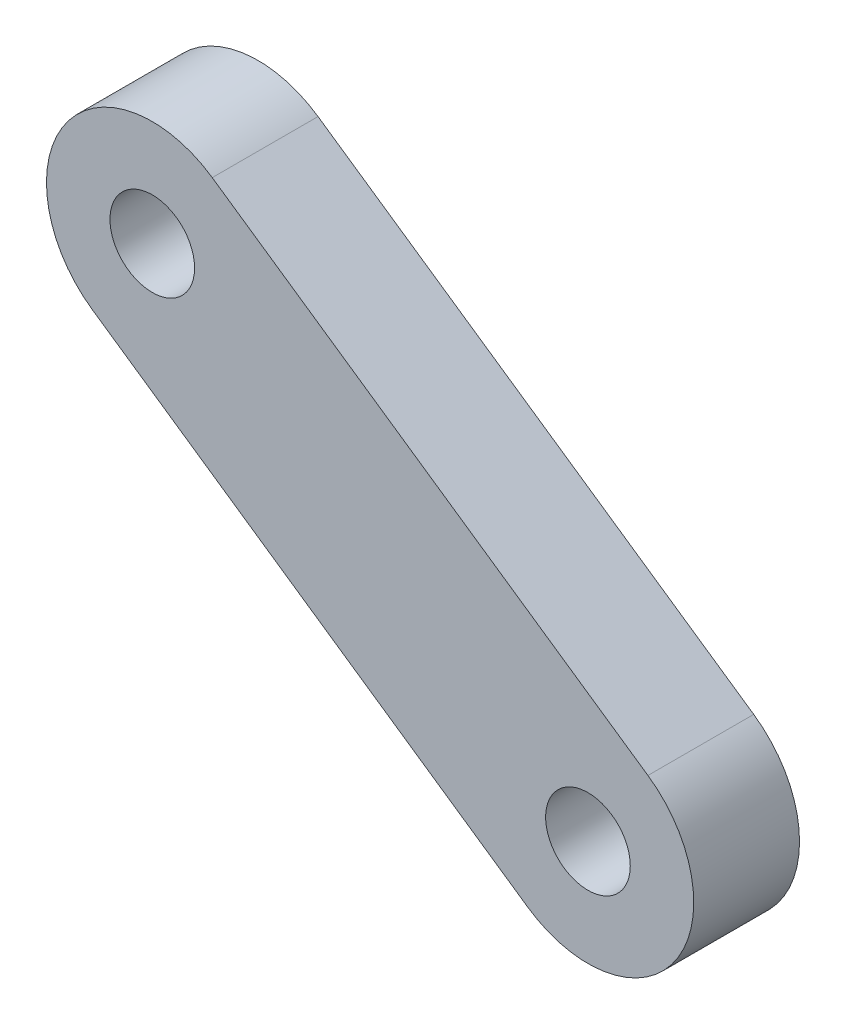
ISO-10303-21;
HEADER;
FILE_DESCRIPTION(('STEP AP214'),'2;1');
FILE_NAME('part.step','',(''),(''),'','','');
FILE_SCHEMA(('AUTOMOTIVE_DESIGN { 1 0 10303 214 1 1 1 1 }'));
ENDSEC;
DATA;
#1=APPLICATION_CONTEXT('core data for automotive mechanical design processes');
#2=APPLICATION_PROTOCOL_DEFINITION('international standard','automotive_design',2000,#1);
#3=PRODUCT_CONTEXT('',#1,'mechanical');
#4=PRODUCT('Part','Part','',(#3));
#5=PRODUCT_RELATED_PRODUCT_CATEGORY('part','',(#4));
#6=PRODUCT_DEFINITION_FORMATION('','',#4);
#7=PRODUCT_DEFINITION_CONTEXT('part definition',#1,'design');
#8=PRODUCT_DEFINITION('design','',#6,#7);
#9=PRODUCT_DEFINITION_SHAPE('','',#8);
#10=(LENGTH_UNIT() NAMED_UNIT(*) SI_UNIT(.MILLI.,.METRE.));
#11=(NAMED_UNIT(*) PLANE_ANGLE_UNIT() SI_UNIT($,.RADIAN.));
#12=(NAMED_UNIT(*) SI_UNIT($,.STERADIAN.) SOLID_ANGLE_UNIT());
#13=UNCERTAINTY_MEASURE_WITH_UNIT(LENGTH_MEASURE(1.E-05),#10,'distance_accuracy_value','');
#14=(GEOMETRIC_REPRESENTATION_CONTEXT(3) GLOBAL_UNCERTAINTY_ASSIGNED_CONTEXT((#13)) GLOBAL_UNIT_ASSIGNED_CONTEXT((#10,
#11,#12)) REPRESENTATION_CONTEXT('',''));
#15=CARTESIAN_POINT('',(0.,0.,0.));
#16=DIRECTION('',(0.,0.,1.));
#17=DIRECTION('',(1.,0.,0.));
#18=AXIS2_PLACEMENT_3D('',#15,#16,#17);
#19=CARTESIAN_POINT('',(22.4546862512256,32.6242146663216,5.));
#20=DIRECTION('',(0.566966615087807,0.823740770737903,0.));
#21=DIRECTION('',(-0.823740770737903,0.566966615087807,0.));
#22=AXIS2_PLACEMENT_3D('',#19,#20,#21);
#23=PLANE('',#22);
#24=DIRECTION('',(0.823740770737903,-0.566966615087807,0.));
#25=VECTOR('',#24,1.);
#26=CARTESIAN_POINT('',(22.4546862512256,32.6242146663216,0.));
#27=LINE('',#26,#25);
#28=CARTESIAN_POINT('',(-47.2149749394553,80.5766450701372,0.));
#29=VERTEX_POINT('',#28);
#30=CARTESIAN_POINT('',(-26.6214556710077,66.402479692942,0.));
#31=VERTEX_POINT('',#30);
#32=EDGE_CURVE('E106',#29,#31,#27,.T.);
#33=ORIENTED_EDGE('',*,*,#32,.T.);
#34=DIRECTION('',(0.,0.,-1.));
#35=VECTOR('',#34,1.);
#36=CARTESIAN_POINT('',(-26.6214556710077,66.402479692942,5.));
#37=LINE('',#36,#35);
#38=CARTESIAN_POINT('',(-26.6214556710077,66.402479692942,5.));
#39=VERTEX_POINT('',#38);
#40=EDGE_CURVE('E11',#39,#31,#37,.T.);
#41=ORIENTED_EDGE('',*,*,#40,.F.);
#42=DIRECTION('',(0.823740770737903,-0.566966615087807,0.));
#43=VECTOR('',#42,1.);
#44=CARTESIAN_POINT('',(22.4546862512256,32.6242146663216,5.));
#45=LINE('',#44,#43);
#46=CARTESIAN_POINT('',(-47.2149749394553,80.5766450701372,5.));
#47=VERTEX_POINT('',#46);
#48=EDGE_CURVE('E85',#47,#39,#45,.T.);
#49=ORIENTED_EDGE('',*,*,#48,.F.);
#50=DIRECTION('',(0.,0.,-1.));
#51=VECTOR('',#50,1.);
#52=CARTESIAN_POINT('',(-47.2149749394553,80.5766450701372,5.));
#53=LINE('',#52,#51);
#54=EDGE_CURVE('E96',#47,#29,#53,.T.);
#55=ORIENTED_EDGE('',*,*,#54,.T.);
#56=EDGE_LOOP('',(#33,#41,#49,#55));
#57=FACE_BOUND('',#56,.T.);
#58=ADVANCED_FACE('F37',(#57),#23,.F.);
#59=CARTESIAN_POINT('',(-23.7866225955687,70.5211835466315,5.));
#60=DIRECTION('',(0.,0.,-1.));
#61=DIRECTION('',(-1.,0.,0.));
#62=AXIS2_PLACEMENT_3D('',#59,#60,#61);
#63=CYLINDRICAL_SURFACE('',#62,4.99999999999997);
#64=CARTESIAN_POINT('',(-23.7866225955687,70.5211835466315,0.));
#65=DIRECTION('',(0.,0.,1.));
#66=DIRECTION('',(1.,0.,0.));
#67=AXIS2_PLACEMENT_3D('',#64,#65,#66);
#68=CIRCLE('',#67,4.99999999999997);
#69=CARTESIAN_POINT('',(-20.9517895201297,74.639887400321,0.));
#70=VERTEX_POINT('',#69);
#71=EDGE_CURVE('E90',#31,#70,#68,.T.);
#72=ORIENTED_EDGE('',*,*,#71,.T.);
#73=DIRECTION('',(0.,0.,-1.));
#74=VECTOR('',#73,1.);
#75=CARTESIAN_POINT('',(-20.9517895201297,74.639887400321,5.));
#76=LINE('',#75,#74);
#77=CARTESIAN_POINT('',(-20.9517895201297,74.639887400321,5.));
#78=VERTEX_POINT('',#77);
#79=EDGE_CURVE('E46',#78,#70,#76,.T.);
#80=ORIENTED_EDGE('',*,*,#79,.F.);
#81=CARTESIAN_POINT('',(-23.7866225955687,70.5211835466315,5.));
#82=DIRECTION('',(0.,0.,1.));
#83=DIRECTION('',(1.,0.,0.));
#84=AXIS2_PLACEMENT_3D('',#81,#82,#83);
#85=CIRCLE('',#84,4.99999999999997);
#86=EDGE_CURVE('E80',#39,#78,#85,.T.);
#87=ORIENTED_EDGE('',*,*,#86,.F.);
#88=ORIENTED_EDGE('',*,*,#40,.T.);
#89=EDGE_LOOP('',(#72,#80,#87,#88));
#90=FACE_BOUND('',#89,.T.);
#91=ADVANCED_FACE('F89',(#90),#63,.T.);
#92=CARTESIAN_POINT('',(28.1243524021036,40.8616223737004,5.));
#93=DIRECTION('',(0.56696661508781,0.823740770737901,0.));
#94=DIRECTION('',(-0.823740770737901,0.56696661508781,0.));
#95=AXIS2_PLACEMENT_3D('',#92,#93,#94);
#96=PLANE('',#95);
#97=DIRECTION('',(0.823740770737901,-0.56696661508781,0.));
#98=VECTOR('',#97,1.);
#99=CARTESIAN_POINT('',(28.1243524021036,40.8616223737004,0.));
#100=LINE('',#99,#98);
#101=CARTESIAN_POINT('',(-41.5453087885772,88.8140527775162,0.));
#102=VERTEX_POINT('',#101);
#103=EDGE_CURVE('E110',#102,#70,#100,.T.);
#104=ORIENTED_EDGE('',*,*,#103,.F.);
#105=DIRECTION('',(0.,0.,-1.));
#106=VECTOR('',#105,1.);
#107=CARTESIAN_POINT('',(-41.5453087885772,88.8140527775162,5.));
#108=LINE('',#107,#106);
#109=CARTESIAN_POINT('',(-41.5453087885772,88.8140527775162,5.));
#110=VERTEX_POINT('',#109);
#111=EDGE_CURVE('E70',#110,#102,#108,.T.);
#112=ORIENTED_EDGE('',*,*,#111,.F.);
#113=DIRECTION('',(0.823740770737901,-0.56696661508781,0.));
#114=VECTOR('',#113,1.);
#115=CARTESIAN_POINT('',(28.1243524021036,40.8616223737004,5.));
#116=LINE('',#115,#114);
#117=EDGE_CURVE('E83',#110,#78,#116,.T.);
#118=ORIENTED_EDGE('',*,*,#117,.T.);
#119=ORIENTED_EDGE('',*,*,#79,.T.);
#120=EDGE_LOOP('',(#104,#112,#118,#119));
#121=FACE_BOUND('',#120,.T.);
#122=ADVANCED_FACE('F94',(#121),#96,.T.);
#123=CARTESIAN_POINT('',(-44.3801418640162,84.6953489238267,5.));
#124=DIRECTION('',(0.,0.,-1.));
#125=DIRECTION('',(-1.,0.,0.));
#126=AXIS2_PLACEMENT_3D('',#123,#124,#125);
#127=CYLINDRICAL_SURFACE('',#126,2.);
#128=CARTESIAN_POINT('',(-44.3801418640162,84.6953489238267,5.));
#129=DIRECTION('',(0.,0.,1.));
#130=DIRECTION('',(1.,0.,0.));
#131=AXIS2_PLACEMENT_3D('',#128,#129,#130);
#132=CIRCLE('',#131,2.);
#133=CARTESIAN_POINT('',(-42.3801418640162,84.6953489238267,5.));
#134=VERTEX_POINT('',#133);
#135=EDGE_CURVE('E148',#134,#134,#132,.T.);
#136=ORIENTED_EDGE('',*,*,#135,.T.);
#137=EDGE_LOOP('',(#136));
#138=FACE_BOUND('',#137,.T.);
#139=CARTESIAN_POINT('',(-44.3801418640162,84.6953489238267,0.));
#140=DIRECTION('',(0.,0.,1.));
#141=DIRECTION('',(1.,0.,0.));
#142=AXIS2_PLACEMENT_3D('',#139,#140,#141);
#143=CIRCLE('',#142,2.);
#144=CARTESIAN_POINT('',(-42.3801418640162,84.6953489238267,0.));
#145=VERTEX_POINT('',#144);
#146=EDGE_CURVE('E103',#145,#145,#143,.T.);
#147=ORIENTED_EDGE('',*,*,#146,.F.);
#148=EDGE_LOOP('',(#147));
#149=FACE_BOUND('',#148,.T.);
#150=ADVANCED_FACE('F137',(#138,#149),#127,.F.);
#151=CARTESIAN_POINT('',(-23.7866225955687,70.5211835466315,5.));
#152=DIRECTION('',(0.,0.,-1.));
#153=DIRECTION('',(-1.,0.,0.));
#154=AXIS2_PLACEMENT_3D('',#151,#152,#153);
#155=CYLINDRICAL_SURFACE('',#154,2.00000000000001);
#156=CARTESIAN_POINT('',(-23.7866225955687,70.5211835466315,5.));
#157=DIRECTION('',(0.,0.,1.));
#158=DIRECTION('',(1.,0.,0.));
#159=AXIS2_PLACEMENT_3D('',#156,#157,#158);
#160=CIRCLE('',#159,2.00000000000001);
#161=CARTESIAN_POINT('',(-21.7866225955687,70.5211835466315,5.));
#162=VERTEX_POINT('',#161);
#163=EDGE_CURVE('E113',#162,#162,#160,.T.);
#164=ORIENTED_EDGE('',*,*,#163,.T.);
#165=EDGE_LOOP('',(#164));
#166=FACE_BOUND('',#165,.T.);
#167=CARTESIAN_POINT('',(-23.7866225955687,70.5211835466315,0.));
#168=DIRECTION('',(0.,0.,1.));
#169=DIRECTION('',(1.,0.,0.));
#170=AXIS2_PLACEMENT_3D('',#167,#168,#169);
#171=CIRCLE('',#170,2.00000000000001);
#172=CARTESIAN_POINT('',(-21.7866225955687,70.5211835466315,0.));
#173=VERTEX_POINT('',#172);
#174=EDGE_CURVE('E100',#173,#173,#171,.T.);
#175=ORIENTED_EDGE('',*,*,#174,.F.);
#176=EDGE_LOOP('',(#175));
#177=FACE_BOUND('',#176,.T.);
#178=ADVANCED_FACE('F39',(#166,#177),#155,.F.);
#179=CARTESIAN_POINT('',(-44.3801418640162,84.6953489238267,5.));
#180=DIRECTION('',(0.,0.,-1.));
#181=DIRECTION('',(-1.,0.,0.));
#182=AXIS2_PLACEMENT_3D('',#179,#180,#181);
#183=CYLINDRICAL_SURFACE('',#182,5.);
#184=CARTESIAN_POINT('',(-44.3801418640162,84.6953489238267,0.));
#185=DIRECTION('',(0.,0.,1.));
#186=DIRECTION('',(1.,0.,0.));
#187=AXIS2_PLACEMENT_3D('',#184,#185,#186);
#188=CIRCLE('',#187,5.);
#189=EDGE_CURVE('E73',#102,#29,#188,.T.);
#190=ORIENTED_EDGE('',*,*,#189,.T.);
#191=ORIENTED_EDGE('',*,*,#54,.F.);
#192=CARTESIAN_POINT('',(-44.3801418640162,84.6953489238267,5.));
#193=DIRECTION('',(0.,0.,1.));
#194=DIRECTION('',(1.,0.,0.));
#195=AXIS2_PLACEMENT_3D('',#192,#193,#194);
#196=CIRCLE('',#195,5.);
#197=EDGE_CURVE('E54',#110,#47,#196,.T.);
#198=ORIENTED_EDGE('',*,*,#197,.F.);
#199=ORIENTED_EDGE('',*,*,#111,.T.);
#200=EDGE_LOOP('',(#190,#191,#198,#199));
#201=FACE_BOUND('',#200,.T.);
#202=ADVANCED_FACE('F125',(#201),#183,.T.);
#203=CARTESIAN_POINT('',(0.,0.,5.));
#204=DIRECTION('',(0.,0.,1.));
#205=DIRECTION('',(1.,0.,0.));
#206=AXIS2_PLACEMENT_3D('',#203,#204,#205);
#207=PLANE('',#206);
#208=ORIENTED_EDGE('',*,*,#163,.F.);
#209=EDGE_LOOP('',(#208));
#210=FACE_BOUND('',#209,.T.);
#211=ORIENTED_EDGE('',*,*,#135,.F.);
#212=EDGE_LOOP('',(#211));
#213=FACE_BOUND('',#212,.T.);
#214=ORIENTED_EDGE('',*,*,#48,.T.);
#215=ORIENTED_EDGE('',*,*,#86,.T.);
#216=ORIENTED_EDGE('',*,*,#117,.F.);
#217=ORIENTED_EDGE('',*,*,#197,.T.);
#218=EDGE_LOOP('',(#214,#215,#216,#217));
#219=FACE_BOUND('',#218,.T.);
#220=ADVANCED_FACE('F81',(#210,#213,#219),#207,.T.);
#221=CARTESIAN_POINT('',(0.,0.,0.));
#222=DIRECTION('',(0.,0.,1.));
#223=DIRECTION('',(1.,0.,0.));
#224=AXIS2_PLACEMENT_3D('',#221,#222,#223);
#225=PLANE('',#224);
#226=ORIENTED_EDGE('',*,*,#174,.T.);
#227=EDGE_LOOP('',(#226));
#228=FACE_BOUND('',#227,.T.);
#229=ORIENTED_EDGE('',*,*,#146,.T.);
#230=EDGE_LOOP('',(#229));
#231=FACE_BOUND('',#230,.T.);
#232=ORIENTED_EDGE('',*,*,#32,.F.);
#233=ORIENTED_EDGE('',*,*,#189,.F.);
#234=ORIENTED_EDGE('',*,*,#103,.T.);
#235=ORIENTED_EDGE('',*,*,#71,.F.);
#236=EDGE_LOOP('',(#232,#233,#234,#235));
#237=FACE_BOUND('',#236,.T.);
#238=ADVANCED_FACE('F118',(#228,#231,#237),#225,.F.);
#239=CLOSED_SHELL('',(#58,#91,#122,#150,#178,#202,#220,#238));
#240=MANIFOLD_SOLID_BREP('B2',#239);
#241=ADVANCED_BREP_SHAPE_REPRESENTATION('',(#18,#240),#14);
#242=SHAPE_DEFINITION_REPRESENTATION(#9,#241);
ENDSEC;
END-ISO-10303-21;
